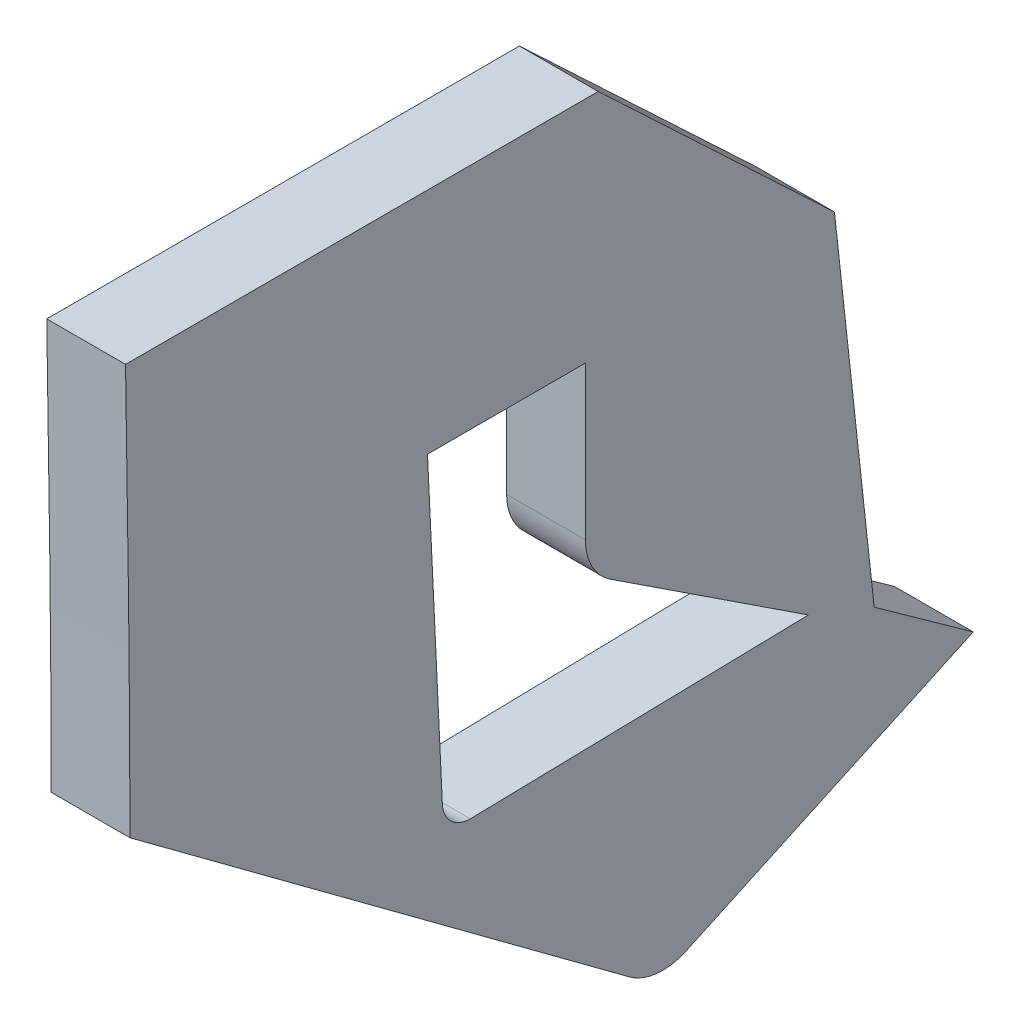
ISO-10303-21;
HEADER;
FILE_DESCRIPTION(('STEP AP214'),'2;1');
FILE_NAME('part.step','',(''),(''),'','','');
FILE_SCHEMA(('AUTOMOTIVE_DESIGN { 1 0 10303 214 1 1 1 1 }'));
ENDSEC;
DATA;
#1=APPLICATION_CONTEXT('core data for automotive mechanical design processes');
#2=APPLICATION_PROTOCOL_DEFINITION('international standard','automotive_design',2000,#1);
#3=PRODUCT_CONTEXT('',#1,'mechanical');
#4=PRODUCT('Part','Part','',(#3));
#5=PRODUCT_RELATED_PRODUCT_CATEGORY('part','',(#4));
#6=PRODUCT_DEFINITION_FORMATION('','',#4);
#7=PRODUCT_DEFINITION_CONTEXT('part definition',#1,'design');
#8=PRODUCT_DEFINITION('design','',#6,#7);
#9=PRODUCT_DEFINITION_SHAPE('','',#8);
#10=(LENGTH_UNIT() NAMED_UNIT(*) SI_UNIT(.MILLI.,.METRE.));
#11=(NAMED_UNIT(*) PLANE_ANGLE_UNIT() SI_UNIT($,.RADIAN.));
#12=(NAMED_UNIT(*) SI_UNIT($,.STERADIAN.) SOLID_ANGLE_UNIT());
#13=UNCERTAINTY_MEASURE_WITH_UNIT(LENGTH_MEASURE(1.E-05),#10,'distance_accuracy_value','');
#14=(GEOMETRIC_REPRESENTATION_CONTEXT(3) GLOBAL_UNCERTAINTY_ASSIGNED_CONTEXT((#13)) GLOBAL_UNIT_ASSIGNED_CONTEXT((#10,
#11,#12)) REPRESENTATION_CONTEXT('',''));
#15=CARTESIAN_POINT('',(0.,0.,0.));
#16=DIRECTION('',(0.,0.,1.));
#17=DIRECTION('',(1.,0.,0.));
#18=AXIS2_PLACEMENT_3D('',#15,#16,#17);
#19=CARTESIAN_POINT('',(4.55229940712902,-38.6709567573075,-7.36599348276084));
#20=DIRECTION('',(-1.,0.,0.));
#21=DIRECTION('',(0.,0.,1.));
#22=AXIS2_PLACEMENT_3D('',#19,#20,#21);
#23=PLANE('',#22);
#24=CARTESIAN_POINT('',(4.55229940712896,-38.2224796646853,-7.90263189265111));
#25=CARTESIAN_POINT('',(4.55229940712897,-38.2563214521924,-7.90425221149753));
#26=CARTESIAN_POINT('',(4.55229940712897,-38.2563214521924,-7.93813276661162));
#27=(BOUNDED_CURVE() B_SPLINE_CURVE(2,(#24,#25,#26),.UNSPECIFIED.,.F.,
.F.) B_SPLINE_CURVE_WITH_KNOTS((3,3),(12.5823730716198,12.6585207530948),
.UNSPECIFIED.) CURVE() GEOMETRIC_REPRESENTATION_ITEM() RATIONAL_B_SPLINE_CURVE((1.,
0.72381781133269,1.)) REPRESENTATION_ITEM(''));
#28=CARTESIAN_POINT('',(4.55229940712896,-38.2224796646853,-7.90263189265111));
#29=VERTEX_POINT('',#28);
#30=CARTESIAN_POINT('',(4.55229940712897,-38.2563214521924,-7.93813276661162));
#31=VERTEX_POINT('',#30);
#32=EDGE_CURVE('E244',#29,#31,#27,.T.);
#33=ORIENTED_EDGE('',*,*,#32,.T.);
#34=CARTESIAN_POINT('',(4.55229940712897,-38.2563214521924,-7.93813276661162));
#35=CARTESIAN_POINT('',(4.55229940712897,-38.2515768780276,-8.15271455597388));
#36=CARTESIAN_POINT('',(4.55229940712897,-38.2468323038627,-8.36729634533614));
#37=(BOUNDED_CURVE() B_SPLINE_CURVE(2,(#34,#35,#36),.UNSPECIFIED.,.F.,
.F.) B_SPLINE_CURVE_WITH_KNOTS((3,3),(12.6585207530948,13.2624175543536),
.UNSPECIFIED.) CURVE() GEOMETRIC_REPRESENTATION_ITEM() RATIONAL_B_SPLINE_CURVE((1.,1.,1.)) REPRESENTATION_ITEM(''));
#38=CARTESIAN_POINT('',(4.55229940712897,-38.2468323038627,-8.36729634533614));
#39=VERTEX_POINT('',#38);
#40=EDGE_CURVE('E260',#31,#39,#37,.T.);
#41=ORIENTED_EDGE('',*,*,#40,.T.);
#42=CARTESIAN_POINT('',(4.55229940712897,-38.2468323038627,-8.36729634533614));
#43=CARTESIAN_POINT('',(4.55229940712896,-38.1636837921452,-8.24060962844583));
#44=CARTESIAN_POINT('',(4.55229940712894,-38.0805352804276,-8.11392291155553));
#45=(BOUNDED_CURVE() B_SPLINE_CURVE(2,(#42,#43,#44),.UNSPECIFIED.,.F.,
.F.) B_SPLINE_CURVE_WITH_KNOTS((3,3),(13.2624175543536,13.6887809664592),
.UNSPECIFIED.) CURVE() GEOMETRIC_REPRESENTATION_ITEM() RATIONAL_B_SPLINE_CURVE((1.,1.,1.)) REPRESENTATION_ITEM(''));
#46=CARTESIAN_POINT('',(4.55229940712894,-38.0805352804276,-8.11392291155553));
#47=VERTEX_POINT('',#46);
#48=EDGE_CURVE('E189',#39,#47,#45,.T.);
#49=ORIENTED_EDGE('',*,*,#48,.T.);
#50=CARTESIAN_POINT('',(4.55229940712894,-38.0805352804276,-8.11392291155553));
#51=CARTESIAN_POINT('',(4.55229940712894,-38.059269590598,-8.08421441756812));
#52=CARTESIAN_POINT('',(4.55229940712894,-38.0227343448902,-8.08421441756813));
#53=(BOUNDED_CURVE() B_SPLINE_CURVE(2,(#50,#51,#52),.UNSPECIFIED.,.F.,
.F.) B_SPLINE_CURVE_WITH_KNOTS((3,3),(13.6887809664592,13.7837346734565),
.UNSPECIFIED.) CURVE() GEOMETRIC_REPRESENTATION_ITEM() RATIONAL_B_SPLINE_CURVE((1.,
0.889398555648739,1.)) REPRESENTATION_ITEM(''));
#54=CARTESIAN_POINT('',(4.55229940712894,-38.0227343448902,-8.08421441756813));
#55=VERTEX_POINT('',#54);
#56=EDGE_CURVE('E185',#47,#55,#53,.T.);
#57=ORIENTED_EDGE('',*,*,#56,.T.);
#58=CARTESIAN_POINT('',(4.55229940712894,-38.0227343448902,-8.08421441756813));
#59=CARTESIAN_POINT('',(4.55229940712892,-37.9255506423211,-8.08421441756816));
#60=CARTESIAN_POINT('',(4.55229940712891,-37.8283669397521,-8.08421441756816));
#61=(BOUNDED_CURVE() B_SPLINE_CURVE(2,(#58,#59,#60),.UNSPECIFIED.,.F.,
.F.) B_SPLINE_CURVE_WITH_KNOTS((3,3),(13.7837346734565,14.0571716058861),
.UNSPECIFIED.) CURVE() GEOMETRIC_REPRESENTATION_ITEM() RATIONAL_B_SPLINE_CURVE((1.,1.,1.)) REPRESENTATION_ITEM(''));
#62=CARTESIAN_POINT('',(4.55229940712891,-37.8283669397521,-8.08421441756816));
#63=VERTEX_POINT('',#62);
#64=EDGE_CURVE('E172',#55,#63,#61,.T.);
#65=ORIENTED_EDGE('',*,*,#64,.T.);
#66=CARTESIAN_POINT('',(4.55229940712891,-37.8283669397521,-8.08421441756816));
#67=CARTESIAN_POINT('',(4.55229940712891,-37.8283669397521,-7.98398824751673));
#68=CARTESIAN_POINT('',(4.55229940712891,-37.8283669397521,-7.8837620774653));
#69=(BOUNDED_CURVE() B_SPLINE_CURVE(2,(#66,#67,#68),.UNSPECIFIED.,.F.,
.F.) B_SPLINE_CURVE_WITH_KNOTS((3,3),(14.0571716058861,14.3391688519631),
.UNSPECIFIED.) CURVE() GEOMETRIC_REPRESENTATION_ITEM() RATIONAL_B_SPLINE_CURVE((1.,1.,1.)) REPRESENTATION_ITEM(''));
#70=CARTESIAN_POINT('',(4.55229940712891,-37.8283669397521,-7.8837620774653));
#71=VERTEX_POINT('',#70);
#72=EDGE_CURVE('E328',#63,#71,#69,.T.);
#73=ORIENTED_EDGE('',*,*,#72,.T.);
#74=CARTESIAN_POINT('',(4.55229940712891,-37.8283669397521,-7.8837620774653));
#75=CARTESIAN_POINT('',(4.55229940712893,-38.0254233022187,-7.8931969850582));
#76=CARTESIAN_POINT('',(4.55229940712896,-38.2224796646853,-7.90263189265111));
#77=(BOUNDED_CURVE() B_SPLINE_CURVE(2,(#74,#75,#76),.UNSPECIFIED.,.F.,
.F.) B_SPLINE_CURVE_WITH_KNOTS((3,3),(14.3391688519631,14.8942435317752),
.UNSPECIFIED.) CURVE() GEOMETRIC_REPRESENTATION_ITEM() RATIONAL_B_SPLINE_CURVE((1.,1.,1.)) REPRESENTATION_ITEM(''));
#78=EDGE_CURVE('E11',#71,#29,#77,.T.);
#79=ORIENTED_EDGE('',*,*,#78,.T.);
#80=EDGE_LOOP('',(#33,#41,#49,#57,#65,#73,#79));
#81=FACE_BOUND('',#80,.T.);
#82=CARTESIAN_POINT('',(4.55229940712901,-38.5310905303576,-8.14008047813413));
#83=CARTESIAN_POINT('',(4.55229940712897,-38.2961109394766,-7.82306107129171));
#84=CARTESIAN_POINT('',(4.55229940712893,-38.0611313485957,-7.50604166444929));
#85=(BOUNDED_CURVE() B_SPLINE_CURVE(2,(#82,#83,#84),.UNSPECIFIED.,.F.,
.F.) B_SPLINE_CURVE_WITH_KNOTS((3,3),(7.77279635836423,8.88307336341004),
.UNSPECIFIED.) CURVE() GEOMETRIC_REPRESENTATION_ITEM() RATIONAL_B_SPLINE_CURVE((1.,1.,1.)) REPRESENTATION_ITEM(''));
#86=CARTESIAN_POINT('',(4.55229940712901,-38.5310905303576,-8.14008047813413));
#87=VERTEX_POINT('',#86);
#88=CARTESIAN_POINT('',(4.55229940712893,-38.0611313485957,-7.50604166444929));
#89=VERTEX_POINT('',#88);
#90=EDGE_CURVE('E287',#87,#89,#85,.T.);
#91=ORIENTED_EDGE('',*,*,#90,.T.);
#92=CARTESIAN_POINT('',(4.55229940712893,-38.0611313485957,-7.50604166444929));
#93=CARTESIAN_POINT('',(4.55229940712892,-37.9590673379174,-7.50604166444929));
#94=CARTESIAN_POINT('',(4.55229940712888,-37.6974772680342,-7.50326656007735));
#95=CARTESIAN_POINT('',(4.55229940712886,-37.5379512088293,-7.50049145570542));
#96=(BOUNDED_CURVE() B_SPLINE_CURVE(2,(#92,#93,#94,#95),.UNSPECIFIED.,.F.,
.F.) B_SPLINE_CURVE_WITH_KNOTS((3,1,3),(8.88307336341004,9.17024157426827,9.61915342651118),
.UNSPECIFIED.) CURVE() GEOMETRIC_REPRESENTATION_ITEM() RATIONAL_B_SPLINE_CURVE((1.,1.,1.,1.)) REPRESENTATION_ITEM(''));
#97=CARTESIAN_POINT('',(4.55229940712886,-37.5379512088293,-7.50049145570542));
#98=VERTEX_POINT('',#97);
#99=EDGE_CURVE('E232',#89,#98,#96,.T.);
#100=ORIENTED_EDGE('',*,*,#99,.T.);
#101=CARTESIAN_POINT('',(4.55229940712886,-37.5379512088293,-7.50049145570542));
#102=CARTESIAN_POINT('',(4.55229940712886,-37.5379512088293,-7.80045447475857));
#103=CARTESIAN_POINT('',(4.55229940712887,-37.5379512088293,-8.10041749381171));
#104=(BOUNDED_CURVE() B_SPLINE_CURVE(2,(#101,#102,#103),.UNSPECIFIED.,.F.,
.F.) B_SPLINE_CURVE_WITH_KNOTS((3,3),(9.61915342651118,10.4631320525979),
.UNSPECIFIED.) CURVE() GEOMETRIC_REPRESENTATION_ITEM() RATIONAL_B_SPLINE_CURVE((1.,1.,1.)) REPRESENTATION_ITEM(''));
#105=CARTESIAN_POINT('',(4.55229940712887,-37.5379512088293,-8.10041749381171));
#106=VERTEX_POINT('',#105);
#107=EDGE_CURVE('E395',#98,#106,#104,.T.);
#108=ORIENTED_EDGE('',*,*,#107,.T.);
#109=CARTESIAN_POINT('',(4.55229940712887,-37.5379512088293,-8.10041749381171));
#110=CARTESIAN_POINT('',(4.55229940712889,-37.6791457739641,-8.25037029536185));
#111=CARTESIAN_POINT('',(4.55229940712891,-37.8203403390988,-8.40032309691199));
#112=(BOUNDED_CURVE() B_SPLINE_CURVE(2,(#109,#110,#111),.UNSPECIFIED.,.F.,
.F.) B_SPLINE_CURVE_WITH_KNOTS((3,3),(10.4631320525979,11.0426381523637),
.UNSPECIFIED.) CURVE() GEOMETRIC_REPRESENTATION_ITEM() RATIONAL_B_SPLINE_CURVE((1.,1.,1.)) REPRESENTATION_ITEM(''));
#113=CARTESIAN_POINT('',(4.55229940712891,-37.8203403390988,-8.40032309691199));
#114=VERTEX_POINT('',#113);
#115=EDGE_CURVE('E221',#106,#114,#112,.T.);
#116=ORIENTED_EDGE('',*,*,#115,.T.);
#117=CARTESIAN_POINT('',(4.55229940712891,-37.8203403390988,-8.40032309691199));
#118=CARTESIAN_POINT('',(4.55229940712894,-38.0501359572194,-8.42551839464377));
#119=CARTESIAN_POINT('',(4.55229940712898,-38.27993157534,-8.45071369237554));
#120=(BOUNDED_CURVE() B_SPLINE_CURVE(2,(#117,#118,#119),.UNSPECIFIED.,.F.,
.F.) B_SPLINE_CURVE_WITH_KNOTS((3,3),(11.0426381523637,11.693067795629),
.UNSPECIFIED.) CURVE() GEOMETRIC_REPRESENTATION_ITEM() RATIONAL_B_SPLINE_CURVE((1.,1.,1.)) REPRESENTATION_ITEM(''));
#121=CARTESIAN_POINT('',(4.55229940712898,-38.27993157534,-8.45071369237554));
#122=VERTEX_POINT('',#121);
#123=EDGE_CURVE('E435',#114,#122,#120,.T.);
#124=ORIENTED_EDGE('',*,*,#123,.T.);
#125=CARTESIAN_POINT('',(4.55229940712898,-38.27993157534,-8.45071369237554));
#126=CARTESIAN_POINT('',(4.55229940712898,-38.3249910921062,-8.51359446581837));
#127=CARTESIAN_POINT('',(4.55229940712899,-38.3700506088723,-8.57647523926119));
#128=(BOUNDED_CURVE() B_SPLINE_CURVE(2,(#125,#126,#127),.UNSPECIFIED.,.F.,
.F.) B_SPLINE_CURVE_WITH_KNOTS((3,3),(11.693067795629,11.9107246194616),
.UNSPECIFIED.) CURVE() GEOMETRIC_REPRESENTATION_ITEM() RATIONAL_B_SPLINE_CURVE((1.,1.,1.)) REPRESENTATION_ITEM(''));
#129=CARTESIAN_POINT('',(4.55229940712899,-38.3700506088723,-8.57647523926119));
#130=VERTEX_POINT('',#129);
#131=EDGE_CURVE('E377',#122,#130,#128,.T.);
#132=ORIENTED_EDGE('',*,*,#131,.T.);
#133=CARTESIAN_POINT('',(4.55229940712899,-38.3700506088723,-8.57647523926119));
#134=CARTESIAN_POINT('',(4.552299407129,-38.4542760138395,-8.39436110174346));
#135=CARTESIAN_POINT('',(4.55229940712901,-38.5385014188068,-8.21224696422573));
#136=(BOUNDED_CURVE() B_SPLINE_CURVE(2,(#133,#134,#135),.UNSPECIFIED.,.F.,
.F.) B_SPLINE_CURVE_WITH_KNOTS((3,3),(11.9107246194616,12.4752686265934),
.UNSPECIFIED.) CURVE() GEOMETRIC_REPRESENTATION_ITEM() RATIONAL_B_SPLINE_CURVE((1.,1.,1.)) REPRESENTATION_ITEM(''));
#137=CARTESIAN_POINT('',(4.55229940712901,-38.5385014188068,-8.21224696422573));
#138=VERTEX_POINT('',#137);
#139=EDGE_CURVE('E303',#130,#138,#136,.T.);
#140=ORIENTED_EDGE('',*,*,#139,.T.);
#141=CARTESIAN_POINT('',(4.55229940712901,-38.5385014188068,-8.21224696422573));
#142=CARTESIAN_POINT('',(4.55229940712901,-38.5562062975794,-8.17396506188546));
#143=CARTESIAN_POINT('',(4.55229940712901,-38.5310905303576,-8.14008047813413));
#144=(BOUNDED_CURVE() B_SPLINE_CURVE(2,(#141,#142,#143),.UNSPECIFIED.,.F.,
.F.) B_SPLINE_CURVE_WITH_KNOTS((3,3),(12.4752686265934,12.5823730716198),
.UNSPECIFIED.) CURVE() GEOMETRIC_REPRESENTATION_ITEM() RATIONAL_B_SPLINE_CURVE((1.,
0.860002260176907,1.)) REPRESENTATION_ITEM(''));
#145=EDGE_CURVE('E107',#138,#87,#144,.T.);
#146=ORIENTED_EDGE('',*,*,#145,.T.);
#147=EDGE_LOOP('',(#91,#100,#108,#116,#124,#132,#140,#146));
#148=FACE_BOUND('',#147,.T.);
#149=ADVANCED_FACE('F16',(#81,#148),#23,.T.);
#150=CARTESIAN_POINT('',(4.65229940712902,-38.6709567573075,-7.36599348276084));
#151=DIRECTION('',(1.,0.,0.));
#152=DIRECTION('',(0.,1.,0.));
#153=AXIS2_PLACEMENT_3D('',#150,#151,#152);
#154=PLANE('',#153);
#155=CARTESIAN_POINT('',(4.65229940712891,-37.8283669397521,-7.8837620774653));
#156=CARTESIAN_POINT('',(4.65229940712894,-38.0254233022187,-7.89319698505821));
#157=CARTESIAN_POINT('',(4.65229940712896,-38.2224796646853,-7.90263189265111));
#158=(BOUNDED_CURVE() B_SPLINE_CURVE(2,(#155,#156,#157),.UNSPECIFIED.,.F.,
.F.) B_SPLINE_CURVE_WITH_KNOTS((3,3),(14.3391688519631,14.8942435317752),
.UNSPECIFIED.) CURVE() GEOMETRIC_REPRESENTATION_ITEM() RATIONAL_B_SPLINE_CURVE((1.,1.,1.)) REPRESENTATION_ITEM(''));
#159=CARTESIAN_POINT('',(4.65229940712891,-37.8283669397521,-7.8837620774653));
#160=VERTEX_POINT('',#159);
#161=CARTESIAN_POINT('',(4.65229940712896,-38.2224796646853,-7.90263189265111));
#162=VERTEX_POINT('',#161);
#163=EDGE_CURVE('E31',#160,#162,#158,.T.);
#164=ORIENTED_EDGE('',*,*,#163,.F.);
#165=CARTESIAN_POINT('',(4.65229940712891,-37.8283669397521,-8.08421441756816));
#166=CARTESIAN_POINT('',(4.65229940712891,-37.8283669397521,-7.98398824751673));
#167=CARTESIAN_POINT('',(4.65229940712891,-37.8283669397521,-7.8837620774653));
#168=(BOUNDED_CURVE() B_SPLINE_CURVE(2,(#165,#166,#167),.UNSPECIFIED.,.F.,
.F.) B_SPLINE_CURVE_WITH_KNOTS((3,3),(14.0571716058861,14.3391688519631),
.UNSPECIFIED.) CURVE() GEOMETRIC_REPRESENTATION_ITEM() RATIONAL_B_SPLINE_CURVE((1.,1.,1.)) REPRESENTATION_ITEM(''));
#169=CARTESIAN_POINT('',(4.65229940712891,-37.8283669397521,-8.08421441756816));
#170=VERTEX_POINT('',#169);
#171=EDGE_CURVE('E182',#170,#160,#168,.T.);
#172=ORIENTED_EDGE('',*,*,#171,.F.);
#173=CARTESIAN_POINT('',(4.65229940712894,-38.0227343448902,-8.08421441756813));
#174=CARTESIAN_POINT('',(4.65229940712892,-37.9255506423211,-8.08421441756816));
#175=CARTESIAN_POINT('',(4.65229940712891,-37.8283669397521,-8.08421441756816));
#176=(BOUNDED_CURVE() B_SPLINE_CURVE(2,(#173,#174,#175),.UNSPECIFIED.,.F.,
.F.) B_SPLINE_CURVE_WITH_KNOTS((3,3),(13.7837346734565,14.0571716058861),
.UNSPECIFIED.) CURVE() GEOMETRIC_REPRESENTATION_ITEM() RATIONAL_B_SPLINE_CURVE((1.,1.,1.)) REPRESENTATION_ITEM(''));
#177=CARTESIAN_POINT('',(4.65229940712894,-38.0227343448902,-8.08421441756813));
#178=VERTEX_POINT('',#177);
#179=EDGE_CURVE('E165',#178,#170,#176,.T.);
#180=ORIENTED_EDGE('',*,*,#179,.F.);
#181=CARTESIAN_POINT('',(4.65229940712894,-38.0805352804276,-8.11392291155553));
#182=CARTESIAN_POINT('',(4.65229940712894,-38.059269590598,-8.08421441756812));
#183=CARTESIAN_POINT('',(4.65229940712894,-38.0227343448902,-8.08421441756813));
#184=(BOUNDED_CURVE() B_SPLINE_CURVE(2,(#181,#182,#183),.UNSPECIFIED.,.F.,
.F.) B_SPLINE_CURVE_WITH_KNOTS((3,3),(13.6887809664592,13.7837346734565),
.UNSPECIFIED.) CURVE() GEOMETRIC_REPRESENTATION_ITEM() RATIONAL_B_SPLINE_CURVE((1.,
0.889398555648739,1.)) REPRESENTATION_ITEM(''));
#185=CARTESIAN_POINT('',(4.65229940712894,-38.0805352804276,-8.11392291155553));
#186=VERTEX_POINT('',#185);
#187=EDGE_CURVE('E196',#186,#178,#184,.T.);
#188=ORIENTED_EDGE('',*,*,#187,.F.);
#189=CARTESIAN_POINT('',(4.65229940712897,-38.2468323038627,-8.36729634533614));
#190=CARTESIAN_POINT('',(4.65229940712896,-38.1636837921452,-8.24060962844583));
#191=CARTESIAN_POINT('',(4.65229940712894,-38.0805352804276,-8.11392291155553));
#192=(BOUNDED_CURVE() B_SPLINE_CURVE(2,(#189,#190,#191),.UNSPECIFIED.,.F.,
.F.) B_SPLINE_CURVE_WITH_KNOTS((3,3),(13.2624175543536,13.6887809664592),
.UNSPECIFIED.) CURVE() GEOMETRIC_REPRESENTATION_ITEM() RATIONAL_B_SPLINE_CURVE((1.,1.,1.)) REPRESENTATION_ITEM(''));
#193=CARTESIAN_POINT('',(4.65229940712897,-38.2468323038627,-8.36729634533614));
#194=VERTEX_POINT('',#193);
#195=EDGE_CURVE('E320',#194,#186,#192,.T.);
#196=ORIENTED_EDGE('',*,*,#195,.F.);
#197=CARTESIAN_POINT('',(4.65229940712897,-38.2563214521924,-7.93813276661162));
#198=CARTESIAN_POINT('',(4.65229940712897,-38.2515768780275,-8.15271455597388));
#199=CARTESIAN_POINT('',(4.65229940712897,-38.2468323038627,-8.36729634533614));
#200=(BOUNDED_CURVE() B_SPLINE_CURVE(2,(#197,#198,#199),.UNSPECIFIED.,.F.,
.F.) B_SPLINE_CURVE_WITH_KNOTS((3,3),(12.6585207530948,13.2624175543536),
.UNSPECIFIED.) CURVE() GEOMETRIC_REPRESENTATION_ITEM() RATIONAL_B_SPLINE_CURVE((1.,1.,1.)) REPRESENTATION_ITEM(''));
#201=CARTESIAN_POINT('',(4.65229940712897,-38.2563214521924,-7.93813276661162));
#202=VERTEX_POINT('',#201);
#203=EDGE_CURVE('E233',#202,#194,#200,.T.);
#204=ORIENTED_EDGE('',*,*,#203,.F.);
#205=CARTESIAN_POINT('',(4.65229940712896,-38.2224796646853,-7.90263189265111));
#206=CARTESIAN_POINT('',(4.65229940712897,-38.2563214521924,-7.90425221149753));
#207=CARTESIAN_POINT('',(4.65229940712897,-38.2563214521924,-7.93813276661162));
#208=(BOUNDED_CURVE() B_SPLINE_CURVE(2,(#205,#206,#207),.UNSPECIFIED.,.F.,
.F.) B_SPLINE_CURVE_WITH_KNOTS((3,3),(12.5823730716198,12.6585207530948),
.UNSPECIFIED.) CURVE() GEOMETRIC_REPRESENTATION_ITEM() RATIONAL_B_SPLINE_CURVE((1.,
0.72381781133269,1.)) REPRESENTATION_ITEM(''));
#209=EDGE_CURVE('E270',#162,#202,#208,.T.);
#210=ORIENTED_EDGE('',*,*,#209,.F.);
#211=EDGE_LOOP('',(#164,#172,#180,#188,#196,#204,#210));
#212=FACE_BOUND('',#211,.T.);
#213=CARTESIAN_POINT('',(4.65229940712901,-38.5385014188068,-8.21224696422573));
#214=CARTESIAN_POINT('',(4.65229940712901,-38.5562062975794,-8.17396506188546));
#215=CARTESIAN_POINT('',(4.65229940712901,-38.5310905303575,-8.14008047813413));
#216=(BOUNDED_CURVE() B_SPLINE_CURVE(2,(#213,#214,#215),.UNSPECIFIED.,.F.,
.F.) B_SPLINE_CURVE_WITH_KNOTS((3,3),(12.4752686265934,12.5823730716198),
.UNSPECIFIED.) CURVE() GEOMETRIC_REPRESENTATION_ITEM() RATIONAL_B_SPLINE_CURVE((1.,
0.860002260176907,1.)) REPRESENTATION_ITEM(''));
#217=CARTESIAN_POINT('',(4.65229940712901,-38.5385014188068,-8.21224696422573));
#218=VERTEX_POINT('',#217);
#219=CARTESIAN_POINT('',(4.65229940712901,-38.5310905303575,-8.14008047813413));
#220=VERTEX_POINT('',#219);
#221=EDGE_CURVE('E121',#218,#220,#216,.T.);
#222=ORIENTED_EDGE('',*,*,#221,.F.);
#223=CARTESIAN_POINT('',(4.65229940712899,-38.3700506088723,-8.5764752392612));
#224=CARTESIAN_POINT('',(4.652299407129,-38.4542760138395,-8.39436110174346));
#225=CARTESIAN_POINT('',(4.65229940712901,-38.5385014188068,-8.21224696422573));
#226=(BOUNDED_CURVE() B_SPLINE_CURVE(2,(#223,#224,#225),.UNSPECIFIED.,.F.,
.F.) B_SPLINE_CURVE_WITH_KNOTS((3,3),(11.9107246194616,12.4752686265934),
.UNSPECIFIED.) CURVE() GEOMETRIC_REPRESENTATION_ITEM() RATIONAL_B_SPLINE_CURVE((1.,1.,1.)) REPRESENTATION_ITEM(''));
#227=CARTESIAN_POINT('',(4.65229940712899,-38.3700506088723,-8.5764752392612));
#228=VERTEX_POINT('',#227);
#229=EDGE_CURVE('E22',#228,#218,#226,.T.);
#230=ORIENTED_EDGE('',*,*,#229,.F.);
#231=CARTESIAN_POINT('',(4.65229940712898,-38.27993157534,-8.45071369237554));
#232=CARTESIAN_POINT('',(4.65229940712898,-38.3249910921061,-8.51359446581837));
#233=CARTESIAN_POINT('',(4.65229940712899,-38.3700506088723,-8.5764752392612));
#234=(BOUNDED_CURVE() B_SPLINE_CURVE(2,(#231,#232,#233),.UNSPECIFIED.,.F.,
.F.) B_SPLINE_CURVE_WITH_KNOTS((3,3),(11.693067795629,11.9107246194616),
.UNSPECIFIED.) CURVE() GEOMETRIC_REPRESENTATION_ITEM() RATIONAL_B_SPLINE_CURVE((1.,1.,1.)) REPRESENTATION_ITEM(''));
#235=CARTESIAN_POINT('',(4.65229940712898,-38.27993157534,-8.45071369237554));
#236=VERTEX_POINT('',#235);
#237=EDGE_CURVE('E427',#236,#228,#234,.T.);
#238=ORIENTED_EDGE('',*,*,#237,.F.);
#239=CARTESIAN_POINT('',(4.65229940712891,-37.8203403390988,-8.400323096912));
#240=CARTESIAN_POINT('',(4.65229940712894,-38.0501359572194,-8.42551839464377));
#241=CARTESIAN_POINT('',(4.65229940712898,-38.27993157534,-8.45071369237554));
#242=(BOUNDED_CURVE() B_SPLINE_CURVE(2,(#239,#240,#241),.UNSPECIFIED.,.F.,
.F.) B_SPLINE_CURVE_WITH_KNOTS((3,3),(11.0426381523637,11.693067795629),
.UNSPECIFIED.) CURVE() GEOMETRIC_REPRESENTATION_ITEM() RATIONAL_B_SPLINE_CURVE((1.,1.,1.)) REPRESENTATION_ITEM(''));
#243=CARTESIAN_POINT('',(4.65229940712891,-37.8203403390988,-8.400323096912));
#244=VERTEX_POINT('',#243);
#245=EDGE_CURVE('E212',#244,#236,#242,.T.);
#246=ORIENTED_EDGE('',*,*,#245,.F.);
#247=CARTESIAN_POINT('',(4.65229940712887,-37.5379512088293,-8.10041749381171));
#248=CARTESIAN_POINT('',(4.65229940712889,-37.679145773964,-8.25037029536185));
#249=CARTESIAN_POINT('',(4.65229940712891,-37.8203403390988,-8.400323096912));
#250=(BOUNDED_CURVE() B_SPLINE_CURVE(2,(#247,#248,#249),.UNSPECIFIED.,.F.,
.F.) B_SPLINE_CURVE_WITH_KNOTS((3,3),(10.4631320525979,11.0426381523637),
.UNSPECIFIED.) CURVE() GEOMETRIC_REPRESENTATION_ITEM() RATIONAL_B_SPLINE_CURVE((1.,1.,1.)) REPRESENTATION_ITEM(''));
#251=CARTESIAN_POINT('',(4.65229940712887,-37.5379512088293,-8.10041749381171));
#252=VERTEX_POINT('',#251);
#253=EDGE_CURVE('E386',#252,#244,#250,.T.);
#254=ORIENTED_EDGE('',*,*,#253,.F.);
#255=CARTESIAN_POINT('',(4.65229940712886,-37.5379512088293,-7.50049145570542));
#256=CARTESIAN_POINT('',(4.65229940712886,-37.5379512088293,-7.80045447475857));
#257=CARTESIAN_POINT('',(4.65229940712887,-37.5379512088293,-8.10041749381171));
#258=(BOUNDED_CURVE() B_SPLINE_CURVE(2,(#255,#256,#257),.UNSPECIFIED.,.F.,
.F.) B_SPLINE_CURVE_WITH_KNOTS((3,3),(9.61915342651118,10.4631320525979),
.UNSPECIFIED.) CURVE() GEOMETRIC_REPRESENTATION_ITEM() RATIONAL_B_SPLINE_CURVE((1.,1.,1.)) REPRESENTATION_ITEM(''));
#259=CARTESIAN_POINT('',(4.65229940712886,-37.5379512088293,-7.50049145570542));
#260=VERTEX_POINT('',#259);
#261=EDGE_CURVE('E222',#260,#252,#258,.T.);
#262=ORIENTED_EDGE('',*,*,#261,.F.);
#263=CARTESIAN_POINT('',(4.65229940712894,-38.0611313485957,-7.50604166444929));
#264=CARTESIAN_POINT('',(4.65229940712892,-37.9590673379174,-7.50604166444929));
#265=CARTESIAN_POINT('',(4.65229940712888,-37.6974772680342,-7.50326656007736));
#266=CARTESIAN_POINT('',(4.65229940712886,-37.5379512088293,-7.50049145570542));
#267=(BOUNDED_CURVE() B_SPLINE_CURVE(2,(#263,#264,#265,#266),.UNSPECIFIED.,.F.,
.F.) B_SPLINE_CURVE_WITH_KNOTS((3,1,3),(8.88307336341004,9.17024157426827,9.61915342651118),
.UNSPECIFIED.) CURVE() GEOMETRIC_REPRESENTATION_ITEM() RATIONAL_B_SPLINE_CURVE((1.,1.,1.,1.)) REPRESENTATION_ITEM(''));
#268=CARTESIAN_POINT('',(4.65229940712894,-38.0611313485957,-7.50604166444929));
#269=VERTEX_POINT('',#268);
#270=EDGE_CURVE('E286',#269,#260,#267,.T.);
#271=ORIENTED_EDGE('',*,*,#270,.F.);
#272=CARTESIAN_POINT('',(4.65229940712901,-38.5310905303575,-8.14008047813413));
#273=CARTESIAN_POINT('',(4.65229940712897,-38.2961109394766,-7.82306107129171));
#274=CARTESIAN_POINT('',(4.65229940712894,-38.0611313485957,-7.50604166444929));
#275=(BOUNDED_CURVE() B_SPLINE_CURVE(2,(#272,#273,#274),.UNSPECIFIED.,.F.,
.F.) B_SPLINE_CURVE_WITH_KNOTS((3,3),(7.77279635836423,8.88307336341004),
.UNSPECIFIED.) CURVE() GEOMETRIC_REPRESENTATION_ITEM() RATIONAL_B_SPLINE_CURVE((1.,1.,1.)) REPRESENTATION_ITEM(''));
#276=EDGE_CURVE('E344',#220,#269,#275,.T.);
#277=ORIENTED_EDGE('',*,*,#276,.F.);
#278=EDGE_LOOP('',(#222,#230,#238,#246,#254,#262,#271,#277));
#279=FACE_BOUND('',#278,.T.);
#280=ADVANCED_FACE('F577',(#212,#279),#154,.T.);
#281=CARTESIAN_POINT('',(4.65229940712891,-37.8283669397521,-7.8837620774653));
#282=CARTESIAN_POINT('',(4.55229940712891,-37.8283669397521,-7.8837620774653));
#283=CARTESIAN_POINT('',(4.65229940712894,-38.0254233022187,-7.89319698505821));
#284=CARTESIAN_POINT('',(4.55229940712893,-38.0254233022187,-7.8931969850582));
#285=CARTESIAN_POINT('',(4.65229940712896,-38.2224796646853,-7.90263189265111));
#286=CARTESIAN_POINT('',(4.55229940712896,-38.2224796646853,-7.90263189265111));
#287=(BOUNDED_SURFACE() B_SPLINE_SURFACE(2,1,((#281,#282),(#283,#284),(#285,#286)),
.UNSPECIFIED.,.F.,.F.,.F.) B_SPLINE_SURFACE_WITH_KNOTS((3,3),(2,2),(14.3391688519631,
14.8942435317752),(0.,0.1),
.UNSPECIFIED.) GEOMETRIC_REPRESENTATION_ITEM() RATIONAL_B_SPLINE_SURFACE(((1.,1.),(1.,1.),(1.,1.))) REPRESENTATION_ITEM('') SURFACE());
#288=CARTESIAN_POINT('',(4.65229940712896,-38.2224796646853,-7.90263189265111));
#289=CARTESIAN_POINT('',(4.55229940712896,-38.2224796646853,-7.90263189265111));
#290=(BOUNDED_CURVE() B_SPLINE_CURVE(1,(#288,#289),.UNSPECIFIED.,.F.,
.F.) B_SPLINE_CURVE_WITH_KNOTS((2,2),(0.,0.1),
.UNSPECIFIED.) CURVE() GEOMETRIC_REPRESENTATION_ITEM() RATIONAL_B_SPLINE_CURVE((1.,1.)) REPRESENTATION_ITEM(''));
#291=EDGE_CURVE('E243',#162,#29,#290,.T.);
#292=CARTESIAN_POINT('',(4.65229940712891,-37.8283669397521,-7.8837620774653));
#293=CARTESIAN_POINT('',(4.55229940712891,-37.8283669397521,-7.8837620774653));
#294=(BOUNDED_CURVE() B_SPLINE_CURVE(1,(#292,#293),.UNSPECIFIED.,.F.,
.F.) B_SPLINE_CURVE_WITH_KNOTS((2,2),(0.,0.1),
.UNSPECIFIED.) CURVE() GEOMETRIC_REPRESENTATION_ITEM() RATIONAL_B_SPLINE_CURVE((1.,1.)) REPRESENTATION_ITEM(''));
#295=EDGE_CURVE('E336',#160,#71,#294,.T.);
#296=ORIENTED_EDGE('',*,*,#163,.T.);
#297=ORIENTED_EDGE('',*,*,#291,.T.);
#298=ORIENTED_EDGE('',*,*,#78,.F.);
#299=ORIENTED_EDGE('',*,*,#295,.F.);
#300=EDGE_LOOP('',(#296,#297,#298,#299));
#301=FACE_BOUND('',#300,.T.);
#302=ADVANCED_FACE('F18',(#301),#287,.T.);
#303=CARTESIAN_POINT('',(4.65229940712891,-37.8283669397521,-8.08421441756816));
#304=CARTESIAN_POINT('',(4.55229940712891,-37.8283669397521,-8.08421441756816));
#305=CARTESIAN_POINT('',(4.65229940712891,-37.8283669397521,-7.98398824751673));
#306=CARTESIAN_POINT('',(4.55229940712891,-37.8283669397521,-7.98398824751673));
#307=CARTESIAN_POINT('',(4.65229940712891,-37.8283669397521,-7.8837620774653));
#308=CARTESIAN_POINT('',(4.55229940712891,-37.8283669397521,-7.8837620774653));
#309=(BOUNDED_SURFACE() B_SPLINE_SURFACE(2,1,((#303,#304),(#305,#306),(#307,#308)),
.UNSPECIFIED.,.F.,.F.,.F.) B_SPLINE_SURFACE_WITH_KNOTS((3,3),(2,2),(14.0571716058861,
14.3391688519631),(0.,0.1),
.UNSPECIFIED.) GEOMETRIC_REPRESENTATION_ITEM() RATIONAL_B_SPLINE_SURFACE(((1.,1.),(1.,1.),(1.,1.))) REPRESENTATION_ITEM('') SURFACE());
#310=CARTESIAN_POINT('',(4.65229940712891,-37.8283669397521,-8.08421441756816));
#311=CARTESIAN_POINT('',(4.55229940712891,-37.8283669397521,-8.08421441756816));
#312=(BOUNDED_CURVE() B_SPLINE_CURVE(1,(#310,#311),.UNSPECIFIED.,.F.,
.F.) B_SPLINE_CURVE_WITH_KNOTS((2,2),(0.,0.1),
.UNSPECIFIED.) CURVE() GEOMETRIC_REPRESENTATION_ITEM() RATIONAL_B_SPLINE_CURVE((1.,1.)) REPRESENTATION_ITEM(''));
#313=EDGE_CURVE('E179',#170,#63,#312,.T.);
#314=ORIENTED_EDGE('',*,*,#171,.T.);
#315=ORIENTED_EDGE('',*,*,#295,.T.);
#316=ORIENTED_EDGE('',*,*,#72,.F.);
#317=ORIENTED_EDGE('',*,*,#313,.F.);
#318=EDGE_LOOP('',(#314,#315,#316,#317));
#319=FACE_BOUND('',#318,.T.);
#320=ADVANCED_FACE('F584',(#319),#309,.T.);
#321=CARTESIAN_POINT('',(4.65229940712894,-38.0227343448902,-8.08421441756813));
#322=CARTESIAN_POINT('',(4.55229940712894,-38.0227343448902,-8.08421441756813));
#323=CARTESIAN_POINT('',(4.65229940712892,-37.9255506423211,-8.08421441756816));
#324=CARTESIAN_POINT('',(4.55229940712892,-37.9255506423211,-8.08421441756816));
#325=CARTESIAN_POINT('',(4.65229940712891,-37.8283669397521,-8.08421441756816));
#326=CARTESIAN_POINT('',(4.55229940712891,-37.8283669397521,-8.08421441756816));
#327=(BOUNDED_SURFACE() B_SPLINE_SURFACE(2,1,((#321,#322),(#323,#324),(#325,#326)),
.UNSPECIFIED.,.F.,.F.,.F.) B_SPLINE_SURFACE_WITH_KNOTS((3,3),(2,2),(13.7837346734565,
14.0571716058861),(0.,0.1),
.UNSPECIFIED.) GEOMETRIC_REPRESENTATION_ITEM() RATIONAL_B_SPLINE_SURFACE(((1.,1.),(1.,1.),(1.,1.))) REPRESENTATION_ITEM('') SURFACE());
#328=CARTESIAN_POINT('',(4.65229940712894,-38.0227343448902,-8.08421441756813));
#329=CARTESIAN_POINT('',(4.55229940712894,-38.0227343448902,-8.08421441756813));
#330=(BOUNDED_CURVE() B_SPLINE_CURVE(1,(#328,#329),.UNSPECIFIED.,.F.,
.F.) B_SPLINE_CURVE_WITH_KNOTS((2,2),(0.,0.1),
.UNSPECIFIED.) CURVE() GEOMETRIC_REPRESENTATION_ITEM() RATIONAL_B_SPLINE_CURVE((1.,1.)) REPRESENTATION_ITEM(''));
#331=EDGE_CURVE('E176',#178,#55,#330,.T.);
#332=ORIENTED_EDGE('',*,*,#179,.T.);
#333=ORIENTED_EDGE('',*,*,#313,.T.);
#334=ORIENTED_EDGE('',*,*,#64,.F.);
#335=ORIENTED_EDGE('',*,*,#331,.F.);
#336=EDGE_LOOP('',(#332,#333,#334,#335));
#337=FACE_BOUND('',#336,.T.);
#338=ADVANCED_FACE('F174',(#337),#327,.T.);
#339=CARTESIAN_POINT('',(4.65229940712894,-38.0805352804276,-8.11392291155553));
#340=CARTESIAN_POINT('',(4.55229940712894,-38.0805352804276,-8.11392291155553));
#341=CARTESIAN_POINT('',(4.65229940712894,-38.059269590598,-8.08421441756812));
#342=CARTESIAN_POINT('',(4.55229940712894,-38.059269590598,-8.08421441756812));
#343=CARTESIAN_POINT('',(4.65229940712894,-38.0227343448902,-8.08421441756813));
#344=CARTESIAN_POINT('',(4.55229940712894,-38.0227343448902,-8.08421441756813));
#345=(BOUNDED_SURFACE() B_SPLINE_SURFACE(2,1,((#339,#340),(#341,#342),(#343,#344)),
.UNSPECIFIED.,.F.,.F.,.F.) B_SPLINE_SURFACE_WITH_KNOTS((3,3),(2,2),(13.6887809664592,
13.7837346734565),(0.,0.1),
.UNSPECIFIED.) GEOMETRIC_REPRESENTATION_ITEM() RATIONAL_B_SPLINE_SURFACE(((1.,1.),
(0.889398555648739,0.889398555648739),(1.,1.))) REPRESENTATION_ITEM('') SURFACE());
#346=CARTESIAN_POINT('',(4.65229940712894,-38.0805352804276,-8.11392291155553));
#347=CARTESIAN_POINT('',(4.55229940712894,-38.0805352804276,-8.11392291155553));
#348=(BOUNDED_CURVE() B_SPLINE_CURVE(1,(#346,#347),.UNSPECIFIED.,.F.,
.F.) B_SPLINE_CURVE_WITH_KNOTS((2,2),(0.,0.1),
.UNSPECIFIED.) CURVE() GEOMETRIC_REPRESENTATION_ITEM() RATIONAL_B_SPLINE_CURVE((1.,1.)) REPRESENTATION_ITEM(''));
#349=EDGE_CURVE('E312',#186,#47,#348,.T.);
#350=ORIENTED_EDGE('',*,*,#187,.T.);
#351=ORIENTED_EDGE('',*,*,#331,.T.);
#352=ORIENTED_EDGE('',*,*,#56,.F.);
#353=ORIENTED_EDGE('',*,*,#349,.F.);
#354=EDGE_LOOP('',(#350,#351,#352,#353));
#355=FACE_BOUND('',#354,.T.);
#356=ADVANCED_FACE('F195',(#355),#345,.T.);
#357=CARTESIAN_POINT('',(4.65229940712897,-38.2468323038627,-8.36729634533614));
#358=CARTESIAN_POINT('',(4.55229940712897,-38.2468323038627,-8.36729634533614));
#359=CARTESIAN_POINT('',(4.65229940712896,-38.1636837921452,-8.24060962844583));
#360=CARTESIAN_POINT('',(4.55229940712896,-38.1636837921452,-8.24060962844583));
#361=CARTESIAN_POINT('',(4.65229940712894,-38.0805352804276,-8.11392291155553));
#362=CARTESIAN_POINT('',(4.55229940712894,-38.0805352804276,-8.11392291155553));
#363=(BOUNDED_SURFACE() B_SPLINE_SURFACE(2,1,((#357,#358),(#359,#360),(#361,#362)),
.UNSPECIFIED.,.F.,.F.,.F.) B_SPLINE_SURFACE_WITH_KNOTS((3,3),(2,2),(13.2624175543536,
13.6887809664592),(0.,0.1),
.UNSPECIFIED.) GEOMETRIC_REPRESENTATION_ITEM() RATIONAL_B_SPLINE_SURFACE(((1.,1.),(1.,1.),(1.,1.))) REPRESENTATION_ITEM('') SURFACE());
#364=CARTESIAN_POINT('',(4.65229940712897,-38.2468323038627,-8.36729634533614));
#365=CARTESIAN_POINT('',(4.55229940712897,-38.2468323038627,-8.36729634533614));
#366=(BOUNDED_CURVE() B_SPLINE_CURVE(1,(#364,#365),.UNSPECIFIED.,.F.,
.F.) B_SPLINE_CURVE_WITH_KNOTS((2,2),(0.,0.1),
.UNSPECIFIED.) CURVE() GEOMETRIC_REPRESENTATION_ITEM() RATIONAL_B_SPLINE_CURVE((1.,1.)) REPRESENTATION_ITEM(''));
#367=EDGE_CURVE('E242',#194,#39,#366,.T.);
#368=ORIENTED_EDGE('',*,*,#195,.T.);
#369=ORIENTED_EDGE('',*,*,#349,.T.);
#370=ORIENTED_EDGE('',*,*,#48,.F.);
#371=ORIENTED_EDGE('',*,*,#367,.F.);
#372=EDGE_LOOP('',(#368,#369,#370,#371));
#373=FACE_BOUND('',#372,.T.);
#374=ADVANCED_FACE('F646',(#373),#363,.T.);
#375=CARTESIAN_POINT('',(4.65229940712897,-38.2563214521924,-7.93813276661162));
#376=CARTESIAN_POINT('',(4.55229940712897,-38.2563214521924,-7.93813276661162));
#377=CARTESIAN_POINT('',(4.65229940712897,-38.2515768780275,-8.15271455597388));
#378=CARTESIAN_POINT('',(4.55229940712897,-38.2515768780276,-8.15271455597388));
#379=CARTESIAN_POINT('',(4.65229940712897,-38.2468323038627,-8.36729634533614));
#380=CARTESIAN_POINT('',(4.55229940712897,-38.2468323038627,-8.36729634533614));
#381=(BOUNDED_SURFACE() B_SPLINE_SURFACE(2,1,((#375,#376),(#377,#378),(#379,#380)),
.UNSPECIFIED.,.F.,.F.,.F.) B_SPLINE_SURFACE_WITH_KNOTS((3,3),(2,2),(12.6585207530948,
13.2624175543536),(0.,0.1),
.UNSPECIFIED.) GEOMETRIC_REPRESENTATION_ITEM() RATIONAL_B_SPLINE_SURFACE(((1.,1.),(1.,1.),(1.,1.))) REPRESENTATION_ITEM('') SURFACE());
#382=CARTESIAN_POINT('',(4.65229940712897,-38.2563214521924,-7.93813276661162));
#383=CARTESIAN_POINT('',(4.55229940712897,-38.2563214521924,-7.93813276661162));
#384=(BOUNDED_CURVE() B_SPLINE_CURVE(1,(#382,#383),.UNSPECIFIED.,.F.,
.F.) B_SPLINE_CURVE_WITH_KNOTS((2,2),(0.,0.1),
.UNSPECIFIED.) CURVE() GEOMETRIC_REPRESENTATION_ITEM() RATIONAL_B_SPLINE_CURVE((1.,1.)) REPRESENTATION_ITEM(''));
#385=EDGE_CURVE('E208',#202,#31,#384,.T.);
#386=ORIENTED_EDGE('',*,*,#203,.T.);
#387=ORIENTED_EDGE('',*,*,#367,.T.);
#388=ORIENTED_EDGE('',*,*,#40,.F.);
#389=ORIENTED_EDGE('',*,*,#385,.F.);
#390=EDGE_LOOP('',(#386,#387,#388,#389));
#391=FACE_BOUND('',#390,.T.);
#392=ADVANCED_FACE('F581',(#391),#381,.T.);
#393=CARTESIAN_POINT('',(4.65229940712896,-38.2224796646853,-7.90263189265111));
#394=CARTESIAN_POINT('',(4.55229940712896,-38.2224796646853,-7.90263189265111));
#395=CARTESIAN_POINT('',(4.65229940712897,-38.2563214521924,-7.90425221149753));
#396=CARTESIAN_POINT('',(4.55229940712897,-38.2563214521924,-7.90425221149753));
#397=CARTESIAN_POINT('',(4.65229940712897,-38.2563214521924,-7.93813276661162));
#398=CARTESIAN_POINT('',(4.55229940712897,-38.2563214521924,-7.93813276661162));
#399=(BOUNDED_SURFACE() B_SPLINE_SURFACE(2,1,((#393,#394),(#395,#396),(#397,#398)),
.UNSPECIFIED.,.F.,.F.,.F.) B_SPLINE_SURFACE_WITH_KNOTS((3,3),(2,2),(12.5823730716198,
12.6585207530948),(0.,0.1),
.UNSPECIFIED.) GEOMETRIC_REPRESENTATION_ITEM() RATIONAL_B_SPLINE_SURFACE(((1.,1.),
(0.72381781133269,0.72381781133269),(1.,1.))) REPRESENTATION_ITEM('') SURFACE());
#400=ORIENTED_EDGE('',*,*,#209,.T.);
#401=ORIENTED_EDGE('',*,*,#385,.T.);
#402=ORIENTED_EDGE('',*,*,#32,.F.);
#403=ORIENTED_EDGE('',*,*,#291,.F.);
#404=EDGE_LOOP('',(#400,#401,#402,#403));
#405=FACE_BOUND('',#404,.T.);
#406=ADVANCED_FACE('F575',(#405),#399,.T.);
#407=CARTESIAN_POINT('',(4.65229940712901,-38.5385014188068,-8.21224696422573));
#408=CARTESIAN_POINT('',(4.55229940712901,-38.5385014188068,-8.21224696422573));
#409=CARTESIAN_POINT('',(4.65229940712901,-38.5562062975794,-8.17396506188546));
#410=CARTESIAN_POINT('',(4.55229940712901,-38.5562062975794,-8.17396506188546));
#411=CARTESIAN_POINT('',(4.65229940712901,-38.5310905303575,-8.14008047813413));
#412=CARTESIAN_POINT('',(4.55229940712901,-38.5310905303576,-8.14008047813413));
#413=(BOUNDED_SURFACE() B_SPLINE_SURFACE(2,1,((#407,#408),(#409,#410),(#411,#412)),
.UNSPECIFIED.,.F.,.F.,.F.) B_SPLINE_SURFACE_WITH_KNOTS((3,3),(2,2),(12.4752686265934,
12.5823730716198),(0.,0.1),
.UNSPECIFIED.) GEOMETRIC_REPRESENTATION_ITEM() RATIONAL_B_SPLINE_SURFACE(((1.,1.),
(0.860002260176907,0.860002260176907),(1.,1.))) REPRESENTATION_ITEM('') SURFACE());
#414=CARTESIAN_POINT('',(4.65229940712901,-38.5310905303575,-8.14008047813413));
#415=CARTESIAN_POINT('',(4.55229940712901,-38.5310905303576,-8.14008047813413));
#416=(BOUNDED_CURVE() B_SPLINE_CURVE(1,(#414,#415),.UNSPECIFIED.,.F.,
.F.) B_SPLINE_CURVE_WITH_KNOTS((2,2),(0.,0.1),
.UNSPECIFIED.) CURVE() GEOMETRIC_REPRESENTATION_ITEM() RATIONAL_B_SPLINE_CURVE((1.,1.)) REPRESENTATION_ITEM(''));
#417=EDGE_CURVE('E279',#220,#87,#416,.T.);
#418=CARTESIAN_POINT('',(4.65229940712901,-38.5385014188068,-8.21224696422573));
#419=CARTESIAN_POINT('',(4.55229940712901,-38.5385014188068,-8.21224696422573));
#420=(BOUNDED_CURVE() B_SPLINE_CURVE(1,(#418,#419),.UNSPECIFIED.,.F.,
.F.) B_SPLINE_CURVE_WITH_KNOTS((2,2),(0.,0.1),
.UNSPECIFIED.) CURVE() GEOMETRIC_REPRESENTATION_ITEM() RATIONAL_B_SPLINE_CURVE((1.,1.)) REPRESENTATION_ITEM(''));
#421=EDGE_CURVE('E294',#218,#138,#420,.T.);
#422=ORIENTED_EDGE('',*,*,#221,.T.);
#423=ORIENTED_EDGE('',*,*,#417,.T.);
#424=ORIENTED_EDGE('',*,*,#145,.F.);
#425=ORIENTED_EDGE('',*,*,#421,.F.);
#426=EDGE_LOOP('',(#422,#423,#424,#425));
#427=FACE_BOUND('',#426,.T.);
#428=ADVANCED_FACE('F514',(#427),#413,.T.);
#429=CARTESIAN_POINT('',(4.65229940712899,-38.3700506088723,-8.5764752392612));
#430=CARTESIAN_POINT('',(4.55229940712899,-38.3700506088723,-8.57647523926119));
#431=CARTESIAN_POINT('',(4.652299407129,-38.4542760138395,-8.39436110174346));
#432=CARTESIAN_POINT('',(4.552299407129,-38.4542760138395,-8.39436110174346));
#433=CARTESIAN_POINT('',(4.65229940712901,-38.5385014188068,-8.21224696422573));
#434=CARTESIAN_POINT('',(4.55229940712901,-38.5385014188068,-8.21224696422573));
#435=(BOUNDED_SURFACE() B_SPLINE_SURFACE(2,1,((#429,#430),(#431,#432),(#433,#434)),
.UNSPECIFIED.,.F.,.F.,.F.) B_SPLINE_SURFACE_WITH_KNOTS((3,3),(2,2),(11.9107246194616,
12.4752686265934),(0.,0.1),
.UNSPECIFIED.) GEOMETRIC_REPRESENTATION_ITEM() RATIONAL_B_SPLINE_SURFACE(((1.,1.),(1.,1.),(1.,1.))) REPRESENTATION_ITEM('') SURFACE());
#436=CARTESIAN_POINT('',(4.65229940712899,-38.3700506088723,-8.5764752392612));
#437=CARTESIAN_POINT('',(4.55229940712899,-38.3700506088723,-8.57647523926119));
#438=(BOUNDED_CURVE() B_SPLINE_CURVE(1,(#436,#437),.UNSPECIFIED.,.F.,
.F.) B_SPLINE_CURVE_WITH_KNOTS((2,2),(0.,0.1),
.UNSPECIFIED.) CURVE() GEOMETRIC_REPRESENTATION_ITEM() RATIONAL_B_SPLINE_CURVE((1.,1.)) REPRESENTATION_ITEM(''));
#439=EDGE_CURVE('E385',#228,#130,#438,.T.);
#440=ORIENTED_EDGE('',*,*,#229,.T.);
#441=ORIENTED_EDGE('',*,*,#421,.T.);
#442=ORIENTED_EDGE('',*,*,#139,.F.);
#443=ORIENTED_EDGE('',*,*,#439,.F.);
#444=EDGE_LOOP('',(#440,#441,#442,#443));
#445=FACE_BOUND('',#444,.T.);
#446=ADVANCED_FACE('F616',(#445),#435,.T.);
#447=CARTESIAN_POINT('',(4.65229940712898,-38.27993157534,-8.45071369237554));
#448=CARTESIAN_POINT('',(4.55229940712898,-38.27993157534,-8.45071369237554));
#449=CARTESIAN_POINT('',(4.65229940712898,-38.3249910921061,-8.51359446581837));
#450=CARTESIAN_POINT('',(4.55229940712898,-38.3249910921062,-8.51359446581837));
#451=CARTESIAN_POINT('',(4.65229940712899,-38.3700506088723,-8.5764752392612));
#452=CARTESIAN_POINT('',(4.55229940712899,-38.3700506088723,-8.57647523926119));
#453=(BOUNDED_SURFACE() B_SPLINE_SURFACE(2,1,((#447,#448),(#449,#450),(#451,#452)),
.UNSPECIFIED.,.F.,.F.,.F.) B_SPLINE_SURFACE_WITH_KNOTS((3,3),(2,2),(11.693067795629,
11.9107246194616),(0.,0.1),
.UNSPECIFIED.) GEOMETRIC_REPRESENTATION_ITEM() RATIONAL_B_SPLINE_SURFACE(((1.,1.),(1.,1.),(1.,1.))) REPRESENTATION_ITEM('') SURFACE());
#454=CARTESIAN_POINT('',(4.65229940712898,-38.27993157534,-8.45071369237554));
#455=CARTESIAN_POINT('',(4.55229940712898,-38.27993157534,-8.45071369237554));
#456=(BOUNDED_CURVE() B_SPLINE_CURVE(1,(#454,#455),.UNSPECIFIED.,.F.,
.F.) B_SPLINE_CURVE_WITH_KNOTS((2,2),(0.,0.1),
.UNSPECIFIED.) CURVE() GEOMETRIC_REPRESENTATION_ITEM() RATIONAL_B_SPLINE_CURVE((1.,1.)) REPRESENTATION_ITEM(''));
#457=EDGE_CURVE('E220',#236,#122,#456,.T.);
#458=ORIENTED_EDGE('',*,*,#237,.T.);
#459=ORIENTED_EDGE('',*,*,#439,.T.);
#460=ORIENTED_EDGE('',*,*,#131,.F.);
#461=ORIENTED_EDGE('',*,*,#457,.F.);
#462=EDGE_LOOP('',(#458,#459,#460,#461));
#463=FACE_BOUND('',#462,.T.);
#464=ADVANCED_FACE('F614',(#463),#453,.T.);
#465=CARTESIAN_POINT('',(4.65229940712891,-37.8203403390988,-8.400323096912));
#466=CARTESIAN_POINT('',(4.55229940712891,-37.8203403390988,-8.40032309691199));
#467=CARTESIAN_POINT('',(4.65229940712894,-38.0501359572194,-8.42551839464377));
#468=CARTESIAN_POINT('',(4.55229940712894,-38.0501359572194,-8.42551839464377));
#469=CARTESIAN_POINT('',(4.65229940712898,-38.27993157534,-8.45071369237554));
#470=CARTESIAN_POINT('',(4.55229940712898,-38.27993157534,-8.45071369237554));
#471=(BOUNDED_SURFACE() B_SPLINE_SURFACE(2,1,((#465,#466),(#467,#468),(#469,#470)),
.UNSPECIFIED.,.F.,.F.,.F.) B_SPLINE_SURFACE_WITH_KNOTS((3,3),(2,2),(11.0426381523637,
11.693067795629),(0.,0.1),
.UNSPECIFIED.) GEOMETRIC_REPRESENTATION_ITEM() RATIONAL_B_SPLINE_SURFACE(((1.,1.),(1.,1.),(1.,1.))) REPRESENTATION_ITEM('') SURFACE());
#472=CARTESIAN_POINT('',(4.65229940712891,-37.8203403390988,-8.400323096912));
#473=CARTESIAN_POINT('',(4.55229940712891,-37.8203403390988,-8.40032309691199));
#474=(BOUNDED_CURVE() B_SPLINE_CURVE(1,(#472,#473),.UNSPECIFIED.,.F.,
.F.) B_SPLINE_CURVE_WITH_KNOTS((2,2),(0.,0.1),
.UNSPECIFIED.) CURVE() GEOMETRIC_REPRESENTATION_ITEM() RATIONAL_B_SPLINE_CURVE((1.,1.)) REPRESENTATION_ITEM(''));
#475=EDGE_CURVE('E394',#244,#114,#474,.T.);
#476=ORIENTED_EDGE('',*,*,#245,.T.);
#477=ORIENTED_EDGE('',*,*,#457,.T.);
#478=ORIENTED_EDGE('',*,*,#123,.F.);
#479=ORIENTED_EDGE('',*,*,#475,.F.);
#480=EDGE_LOOP('',(#476,#477,#478,#479));
#481=FACE_BOUND('',#480,.T.);
#482=ADVANCED_FACE('F608',(#481),#471,.T.);
#483=CARTESIAN_POINT('',(4.65229940712887,-37.5379512088293,-8.10041749381171));
#484=CARTESIAN_POINT('',(4.55229940712887,-37.5379512088293,-8.10041749381171));
#485=CARTESIAN_POINT('',(4.65229940712889,-37.679145773964,-8.25037029536185));
#486=CARTESIAN_POINT('',(4.55229940712889,-37.6791457739641,-8.25037029536185));
#487=CARTESIAN_POINT('',(4.65229940712891,-37.8203403390988,-8.400323096912));
#488=CARTESIAN_POINT('',(4.55229940712891,-37.8203403390988,-8.40032309691199));
#489=(BOUNDED_SURFACE() B_SPLINE_SURFACE(2,1,((#483,#484),(#485,#486),(#487,#488)),
.UNSPECIFIED.,.F.,.F.,.F.) B_SPLINE_SURFACE_WITH_KNOTS((3,3),(2,2),(10.4631320525979,
11.0426381523637),(0.,0.1),
.UNSPECIFIED.) GEOMETRIC_REPRESENTATION_ITEM() RATIONAL_B_SPLINE_SURFACE(((1.,1.),(1.,1.),(1.,1.))) REPRESENTATION_ITEM('') SURFACE());
#490=CARTESIAN_POINT('',(4.65229940712887,-37.5379512088293,-8.10041749381171));
#491=CARTESIAN_POINT('',(4.55229940712887,-37.5379512088293,-8.10041749381171));
#492=(BOUNDED_CURVE() B_SPLINE_CURVE(1,(#490,#491),.UNSPECIFIED.,.F.,
.F.) B_SPLINE_CURVE_WITH_KNOTS((2,2),(0.,0.1),
.UNSPECIFIED.) CURVE() GEOMETRIC_REPRESENTATION_ITEM() RATIONAL_B_SPLINE_CURVE((1.,1.)) REPRESENTATION_ITEM(''));
#493=EDGE_CURVE('E231',#252,#106,#492,.T.);
#494=ORIENTED_EDGE('',*,*,#253,.T.);
#495=ORIENTED_EDGE('',*,*,#475,.T.);
#496=ORIENTED_EDGE('',*,*,#115,.F.);
#497=ORIENTED_EDGE('',*,*,#493,.F.);
#498=EDGE_LOOP('',(#494,#495,#496,#497));
#499=FACE_BOUND('',#498,.T.);
#500=ADVANCED_FACE('F613',(#499),#489,.T.);
#501=CARTESIAN_POINT('',(4.65229940712886,-37.5379512088293,-7.50049145570542));
#502=CARTESIAN_POINT('',(4.55229940712886,-37.5379512088293,-7.50049145570542));
#503=CARTESIAN_POINT('',(4.65229940712886,-37.5379512088293,-7.80045447475857));
#504=CARTESIAN_POINT('',(4.55229940712886,-37.5379512088293,-7.80045447475857));
#505=CARTESIAN_POINT('',(4.65229940712887,-37.5379512088293,-8.10041749381171));
#506=CARTESIAN_POINT('',(4.55229940712887,-37.5379512088293,-8.10041749381171));
#507=(BOUNDED_SURFACE() B_SPLINE_SURFACE(2,1,((#501,#502),(#503,#504),(#505,#506)),
.UNSPECIFIED.,.F.,.F.,.F.) B_SPLINE_SURFACE_WITH_KNOTS((3,3),(2,2),(9.61915342651118,
10.4631320525979),(0.,0.1),
.UNSPECIFIED.) GEOMETRIC_REPRESENTATION_ITEM() RATIONAL_B_SPLINE_SURFACE(((1.,1.),(1.,1.),(1.,1.))) REPRESENTATION_ITEM('') SURFACE());
#508=CARTESIAN_POINT('',(4.65229940712886,-37.5379512088293,-7.50049145570542));
#509=CARTESIAN_POINT('',(4.55229940712886,-37.5379512088293,-7.50049145570542));
#510=(BOUNDED_CURVE() B_SPLINE_CURVE(1,(#508,#509),.UNSPECIFIED.,.F.,
.F.) B_SPLINE_CURVE_WITH_KNOTS((2,2),(0.,0.1),
.UNSPECIFIED.) CURVE() GEOMETRIC_REPRESENTATION_ITEM() RATIONAL_B_SPLINE_CURVE((1.,1.)) REPRESENTATION_ITEM(''));
#511=EDGE_CURVE('E269',#260,#98,#510,.T.);
#512=ORIENTED_EDGE('',*,*,#261,.T.);
#513=ORIENTED_EDGE('',*,*,#493,.T.);
#514=ORIENTED_EDGE('',*,*,#107,.F.);
#515=ORIENTED_EDGE('',*,*,#511,.F.);
#516=EDGE_LOOP('',(#512,#513,#514,#515));
#517=FACE_BOUND('',#516,.T.);
#518=ADVANCED_FACE('F636',(#517),#507,.T.);
#519=CARTESIAN_POINT('',(4.65229940712894,-38.0611313485957,-7.50604166444929));
#520=CARTESIAN_POINT('',(4.55229940712893,-38.0611313485957,-7.50604166444929));
#521=CARTESIAN_POINT('',(4.65229940712892,-37.9590673379174,-7.50604166444929));
#522=CARTESIAN_POINT('',(4.55229940712892,-37.9590673379174,-7.50604166444929));
#523=CARTESIAN_POINT('',(4.65229940712888,-37.6974772680342,-7.50326656007736));
#524=CARTESIAN_POINT('',(4.55229940712888,-37.6974772680342,-7.50326656007735));
#525=CARTESIAN_POINT('',(4.65229940712886,-37.5379512088293,-7.50049145570542));
#526=CARTESIAN_POINT('',(4.55229940712886,-37.5379512088293,-7.50049145570542));
#527=(BOUNDED_SURFACE() B_SPLINE_SURFACE(2,1,((#519,#520),(#521,#522),(#523,#524),(#525,#526)),
.UNSPECIFIED.,.F.,.F.,.F.) B_SPLINE_SURFACE_WITH_KNOTS((3,1,3),(2,2),(8.88307336341004,
9.17024157426827,9.61915342651118),(0.,0.1),
.UNSPECIFIED.) GEOMETRIC_REPRESENTATION_ITEM() RATIONAL_B_SPLINE_SURFACE(((1.,1.),(1.,1.),(1.,
1.),(1.,1.))) REPRESENTATION_ITEM('') SURFACE());
#528=CARTESIAN_POINT('',(4.65229940712894,-38.0611313485957,-7.50604166444929));
#529=CARTESIAN_POINT('',(4.55229940712893,-38.0611313485957,-7.50604166444929));
#530=(BOUNDED_CURVE() B_SPLINE_CURVE(1,(#528,#529),.UNSPECIFIED.,.F.,
.F.) B_SPLINE_CURVE_WITH_KNOTS((2,2),(0.,0.1),
.UNSPECIFIED.) CURVE() GEOMETRIC_REPRESENTATION_ITEM() RATIONAL_B_SPLINE_CURVE((1.,1.)) REPRESENTATION_ITEM(''));
#531=EDGE_CURVE('E353',#269,#89,#530,.T.);
#532=ORIENTED_EDGE('',*,*,#270,.T.);
#533=ORIENTED_EDGE('',*,*,#511,.T.);
#534=ORIENTED_EDGE('',*,*,#99,.F.);
#535=ORIENTED_EDGE('',*,*,#531,.F.);
#536=EDGE_LOOP('',(#532,#533,#534,#535));
#537=FACE_BOUND('',#536,.T.);
#538=ADVANCED_FACE('F604',(#537),#527,.T.);
#539=CARTESIAN_POINT('',(4.65229940712901,-38.5310905303575,-8.14008047813413));
#540=CARTESIAN_POINT('',(4.55229940712901,-38.5310905303576,-8.14008047813413));
#541=CARTESIAN_POINT('',(4.65229940712897,-38.2961109394766,-7.82306107129171));
#542=CARTESIAN_POINT('',(4.55229940712897,-38.2961109394766,-7.82306107129171));
#543=CARTESIAN_POINT('',(4.65229940712894,-38.0611313485957,-7.50604166444929));
#544=CARTESIAN_POINT('',(4.55229940712893,-38.0611313485957,-7.50604166444929));
#545=(BOUNDED_SURFACE() B_SPLINE_SURFACE(2,1,((#539,#540),(#541,#542),(#543,#544)),
.UNSPECIFIED.,.F.,.F.,.F.) B_SPLINE_SURFACE_WITH_KNOTS((3,3),(2,2),(7.77279635836423,
8.88307336341004),(0.,0.1),
.UNSPECIFIED.) GEOMETRIC_REPRESENTATION_ITEM() RATIONAL_B_SPLINE_SURFACE(((1.,1.),(1.,1.),(1.,1.))) REPRESENTATION_ITEM('') SURFACE());
#546=ORIENTED_EDGE('',*,*,#276,.T.);
#547=ORIENTED_EDGE('',*,*,#531,.T.);
#548=ORIENTED_EDGE('',*,*,#90,.F.);
#549=ORIENTED_EDGE('',*,*,#417,.F.);
#550=EDGE_LOOP('',(#546,#547,#548,#549));
#551=FACE_BOUND('',#550,.T.);
#552=ADVANCED_FACE('F516',(#551),#545,.T.);
#553=CLOSED_SHELL('',(#149,#280,#302,#320,#338,#356,#374,#392,#406,#428,#446,#464,#482,#500,
#518,#538,#552));
#554=MANIFOLD_SOLID_BREP('B1',#553);
#555=ADVANCED_BREP_SHAPE_REPRESENTATION('',(#18,#554),#14);
#556=SHAPE_DEFINITION_REPRESENTATION(#9,#555);
ENDSEC;
END-ISO-10303-21;
